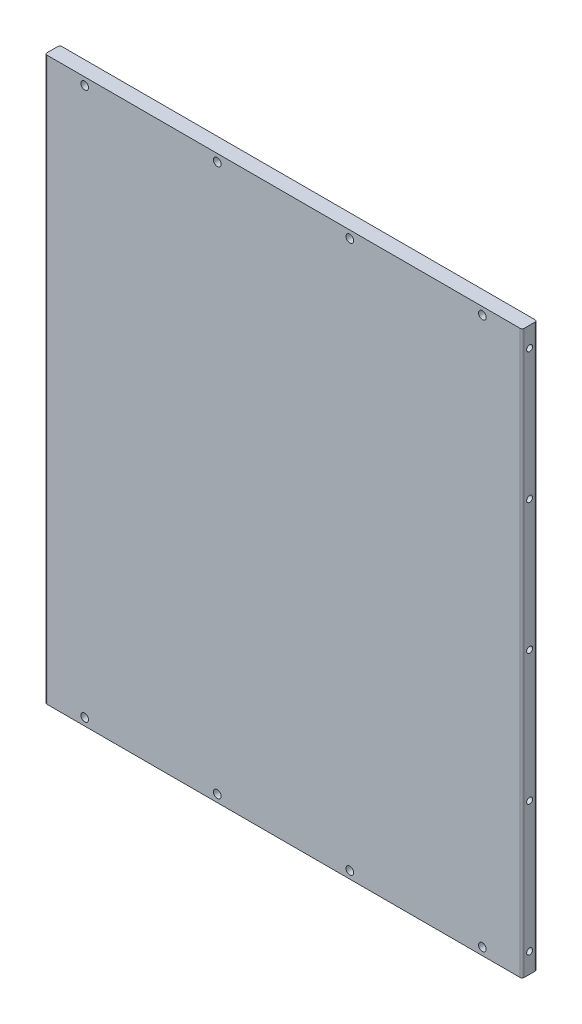
ISO-10303-21;
HEADER;
FILE_DESCRIPTION(('STEP AP214'),'2;1');
FILE_NAME('part.step','',(''),(''),'','','');
FILE_SCHEMA(('AUTOMOTIVE_DESIGN { 1 0 10303 214 1 1 1 1 }'));
ENDSEC;
DATA;
#1=APPLICATION_CONTEXT('core data for automotive mechanical design processes');
#2=APPLICATION_PROTOCOL_DEFINITION('international standard','automotive_design',2000,#1);
#3=PRODUCT_CONTEXT('',#1,'mechanical');
#4=PRODUCT('Part','Part','',(#3));
#5=PRODUCT_RELATED_PRODUCT_CATEGORY('part','',(#4));
#6=PRODUCT_DEFINITION_FORMATION('','',#4);
#7=PRODUCT_DEFINITION_CONTEXT('part definition',#1,'design');
#8=PRODUCT_DEFINITION('design','',#6,#7);
#9=PRODUCT_DEFINITION_SHAPE('','',#8);
#10=(LENGTH_UNIT() NAMED_UNIT(*) SI_UNIT(.MILLI.,.METRE.));
#11=(NAMED_UNIT(*) PLANE_ANGLE_UNIT() SI_UNIT($,.RADIAN.));
#12=(NAMED_UNIT(*) SI_UNIT($,.STERADIAN.) SOLID_ANGLE_UNIT());
#13=UNCERTAINTY_MEASURE_WITH_UNIT(LENGTH_MEASURE(1.E-05),#10,'distance_accuracy_value','');
#14=(GEOMETRIC_REPRESENTATION_CONTEXT(3) GLOBAL_UNCERTAINTY_ASSIGNED_CONTEXT((#13)) GLOBAL_UNIT_ASSIGNED_CONTEXT((#10,
#11,#12)) REPRESENTATION_CONTEXT('',''));
#15=CARTESIAN_POINT('',(0.,0.,0.));
#16=DIRECTION('',(0.,0.,1.));
#17=DIRECTION('',(1.,0.,0.));
#18=AXIS2_PLACEMENT_3D('',#15,#16,#17);
#19=CARTESIAN_POINT('',(49.649999330973,-424.525,9.525));
#20=DIRECTION('',(-1.,0.,0.));
#21=DIRECTION('',(0.,-1.,0.));
#22=AXIS2_PLACEMENT_3D('',#19,#20,#21);
#23=PLANE('',#22);
#24=CARTESIAN_POINT('',(49.649999330973,-411.825,4.76249999999997));
#25=DIRECTION('',(1.,0.,0.));
#26=DIRECTION('',(0.,0.,-1.));
#27=AXIS2_PLACEMENT_3D('',#24,#25,#26);
#28=CIRCLE('',#27,1.89864999999995);
#29=CARTESIAN_POINT('',(49.649999330973,-411.825,2.86385000000002));
#30=VERTEX_POINT('',#29);
#31=EDGE_CURVE('E234',#30,#30,#28,.T.);
#32=ORIENTED_EDGE('',*,*,#31,.F.);
#33=EDGE_LOOP('',(#32));
#34=FACE_BOUND('',#33,.T.);
#35=CARTESIAN_POINT('',(49.649999330973,-328.4125,4.76249999999998));
#36=DIRECTION('',(1.,0.,0.));
#37=DIRECTION('',(0.,0.,-1.));
#38=AXIS2_PLACEMENT_3D('',#35,#36,#37);
#39=CIRCLE('',#38,1.89864999999995);
#40=CARTESIAN_POINT('',(49.649999330973,-328.4125,2.86385000000003));
#41=VERTEX_POINT('',#40);
#42=EDGE_CURVE('E240',#41,#41,#39,.T.);
#43=ORIENTED_EDGE('',*,*,#42,.F.);
#44=EDGE_LOOP('',(#43));
#45=FACE_BOUND('',#44,.T.);
#46=CARTESIAN_POINT('',(49.649999330973,-245.,4.76249999999999));
#47=DIRECTION('',(1.,0.,0.));
#48=DIRECTION('',(0.,0.,-1.));
#49=AXIS2_PLACEMENT_3D('',#46,#47,#48);
#50=CIRCLE('',#49,1.89864999999997);
#51=CARTESIAN_POINT('',(49.649999330973,-245.,2.86385000000001));
#52=VERTEX_POINT('',#51);
#53=EDGE_CURVE('E246',#52,#52,#50,.T.);
#54=ORIENTED_EDGE('',*,*,#53,.F.);
#55=EDGE_LOOP('',(#54));
#56=FACE_BOUND('',#55,.T.);
#57=CARTESIAN_POINT('',(49.6499993309729,-161.5875,4.7625));
#58=DIRECTION('',(1.,0.,0.));
#59=DIRECTION('',(0.,0.,-1.));
#60=AXIS2_PLACEMENT_3D('',#57,#58,#59);
#61=CIRCLE('',#60,1.89864999999997);
#62=CARTESIAN_POINT('',(49.6499993309729,-161.5875,2.86385000000003));
#63=VERTEX_POINT('',#62);
#64=EDGE_CURVE('E252',#63,#63,#61,.T.);
#65=ORIENTED_EDGE('',*,*,#64,.F.);
#66=EDGE_LOOP('',(#65));
#67=FACE_BOUND('',#66,.T.);
#68=CARTESIAN_POINT('',(49.6499993309729,-78.175,4.76250000000002));
#69=DIRECTION('',(1.,0.,0.));
#70=DIRECTION('',(0.,0.,-1.));
#71=AXIS2_PLACEMENT_3D('',#68,#69,#70);
#72=CIRCLE('',#71,1.89864999999996);
#73=CARTESIAN_POINT('',(49.6499993309729,-78.175,2.86385000000006));
#74=VERTEX_POINT('',#73);
#75=EDGE_CURVE('E258',#74,#74,#72,.T.);
#76=ORIENTED_EDGE('',*,*,#75,.F.);
#77=EDGE_LOOP('',(#76));
#78=FACE_BOUND('',#77,.T.);
#79=DIRECTION('',(0.,0.,-1.));
#80=VECTOR('',#79,1.);
#81=CARTESIAN_POINT('',(49.649999330973,-424.525,9.525));
#82=LINE('',#81,#80);
#83=CARTESIAN_POINT('',(49.649999330973,-424.525,8.255));
#84=VERTEX_POINT('',#83);
#85=CARTESIAN_POINT('',(49.649999330973,-424.525,1.27));
#86=VERTEX_POINT('',#85);
#87=EDGE_CURVE('E272',#84,#86,#82,.T.);
#88=ORIENTED_EDGE('',*,*,#87,.T.);
#89=DIRECTION('',(0.,1.,0.));
#90=VECTOR('',#89,1.);
#91=CARTESIAN_POINT('',(49.649999330973,-424.525,1.27));
#92=LINE('',#91,#90);
#93=CARTESIAN_POINT('',(49.6499993309729,-65.475,1.27));
#94=VERTEX_POINT('',#93);
#95=EDGE_CURVE('E11',#86,#94,#92,.T.);
#96=ORIENTED_EDGE('',*,*,#95,.T.);
#97=DIRECTION('',(0.,0.,-1.));
#98=VECTOR('',#97,1.);
#99=CARTESIAN_POINT('',(49.6499993309729,-65.475,9.525));
#100=LINE('',#99,#98);
#101=CARTESIAN_POINT('',(49.6499993309729,-65.475,8.255));
#102=VERTEX_POINT('',#101);
#103=EDGE_CURVE('E285',#102,#94,#100,.T.);
#104=ORIENTED_EDGE('',*,*,#103,.F.);
#105=DIRECTION('',(0.,1.,0.));
#106=VECTOR('',#105,1.);
#107=CARTESIAN_POINT('',(49.649999330973,-424.525,8.255));
#108=LINE('',#107,#106);
#109=EDGE_CURVE('E61',#102,#84,#108,.F.);
#110=ORIENTED_EDGE('',*,*,#109,.T.);
#111=EDGE_LOOP('',(#88,#96,#104,#110));
#112=FACE_BOUND('',#111,.T.);
#113=ADVANCED_FACE('F53',(#34,#45,#56,#67,#78,#112),#23,.F.);
#114=CARTESIAN_POINT('',(49.6499993309729,-65.475,9.525));
#115=DIRECTION('',(0.,-1.,0.));
#116=DIRECTION('',(1.,0.,0.));
#117=AXIS2_PLACEMENT_3D('',#114,#115,#116);
#118=PLANE('',#117);
#119=DIRECTION('',(-1.,0.,0.));
#120=VECTOR('',#119,1.);
#121=CARTESIAN_POINT('',(49.6499993309729,-65.475,0.));
#122=LINE('',#121,#120);
#123=CARTESIAN_POINT('',(48.3799993309729,-65.475,0.));
#124=VERTEX_POINT('',#123);
#125=CARTESIAN_POINT('',(-253.880000669027,-65.475,0.));
#126=VERTEX_POINT('',#125);
#127=EDGE_CURVE('E264',#124,#126,#122,.T.);
#128=ORIENTED_EDGE('',*,*,#127,.T.);
#129=CARTESIAN_POINT('',(-253.880000669027,-65.4750000000001,1.27));
#130=DIRECTION('',(0.,-1.,0.));
#131=DIRECTION('',(1.,0.,0.));
#132=AXIS2_PLACEMENT_3D('',#129,#130,#131);
#133=CIRCLE('',#132,1.27);
#134=CARTESIAN_POINT('',(-255.150000669027,-65.475,1.27));
#135=VERTEX_POINT('',#134);
#136=EDGE_CURVE('E308',#126,#135,#133,.F.);
#137=ORIENTED_EDGE('',*,*,#136,.T.);
#138=DIRECTION('',(0.,0.,-1.));
#139=VECTOR('',#138,1.);
#140=CARTESIAN_POINT('',(-255.150000669027,-65.475,9.525));
#141=LINE('',#140,#139);
#142=CARTESIAN_POINT('',(-255.150000669027,-65.475,8.255));
#143=VERTEX_POINT('',#142);
#144=EDGE_CURVE('E282',#143,#135,#141,.T.);
#145=ORIENTED_EDGE('',*,*,#144,.F.);
#146=CARTESIAN_POINT('',(-253.880000669027,-65.475,8.255));
#147=DIRECTION('',(0.,-1.,0.));
#148=DIRECTION('',(1.,0.,0.));
#149=AXIS2_PLACEMENT_3D('',#146,#147,#148);
#150=CIRCLE('',#149,1.27);
#151=CARTESIAN_POINT('',(-253.880000669027,-65.475,9.525));
#152=VERTEX_POINT('',#151);
#153=EDGE_CURVE('E306',#143,#152,#150,.F.);
#154=ORIENTED_EDGE('',*,*,#153,.T.);
#155=DIRECTION('',(-1.,0.,0.));
#156=VECTOR('',#155,1.);
#157=CARTESIAN_POINT('',(49.6499993309729,-65.475,9.525));
#158=LINE('',#157,#156);
#159=CARTESIAN_POINT('',(48.3799993309729,-65.475,9.525));
#160=VERTEX_POINT('',#159);
#161=EDGE_CURVE('E265',#160,#152,#158,.T.);
#162=ORIENTED_EDGE('',*,*,#161,.F.);
#163=CARTESIAN_POINT('',(48.3799993309729,-65.475,8.255));
#164=DIRECTION('',(0.,-1.,0.));
#165=DIRECTION('',(1.,0.,0.));
#166=AXIS2_PLACEMENT_3D('',#163,#164,#165);
#167=CIRCLE('',#166,1.27);
#168=EDGE_CURVE('E75',#160,#102,#167,.F.);
#169=ORIENTED_EDGE('',*,*,#168,.T.);
#170=ORIENTED_EDGE('',*,*,#103,.T.);
#171=CARTESIAN_POINT('',(48.3799993309729,-65.475,1.27));
#172=DIRECTION('',(0.,-1.,0.));
#173=DIRECTION('',(1.,0.,0.));
#174=AXIS2_PLACEMENT_3D('',#171,#172,#173);
#175=CIRCLE('',#174,1.27);
#176=EDGE_CURVE('E68',#94,#124,#175,.F.);
#177=ORIENTED_EDGE('',*,*,#176,.T.);
#178=EDGE_LOOP('',(#128,#137,#145,#154,#162,#169,#170,#177));
#179=FACE_BOUND('',#178,.T.);
#180=ADVANCED_FACE('F328',(#179),#118,.F.);
#181=CARTESIAN_POINT('',(-255.150000669027,-424.525,9.525));
#182=DIRECTION('',(1.,0.,0.));
#183=DIRECTION('',(0.,0.,-1.));
#184=AXIS2_PLACEMENT_3D('',#181,#182,#183);
#185=PLANE('',#184);
#186=CARTESIAN_POINT('',(-255.150000669027,-411.825,4.76249999999997));
#187=DIRECTION('',(-1.,0.,0.));
#188=DIRECTION('',(0.,0.,1.));
#189=AXIS2_PLACEMENT_3D('',#186,#187,#188);
#190=CIRCLE('',#189,1.89864999999995);
#191=CARTESIAN_POINT('',(-255.150000669027,-411.825,6.66114999999991));
#192=VERTEX_POINT('',#191);
#193=EDGE_CURVE('E158',#192,#192,#190,.T.);
#194=ORIENTED_EDGE('',*,*,#193,.F.);
#195=EDGE_LOOP('',(#194));
#196=FACE_BOUND('',#195,.T.);
#197=CARTESIAN_POINT('',(-255.150000669027,-328.4125,4.76249999999998));
#198=DIRECTION('',(-1.,0.,0.));
#199=DIRECTION('',(0.,0.,1.));
#200=AXIS2_PLACEMENT_3D('',#197,#198,#199);
#201=CIRCLE('',#200,1.89864999999995);
#202=CARTESIAN_POINT('',(-255.150000669027,-328.4125,6.66114999999992));
#203=VERTEX_POINT('',#202);
#204=EDGE_CURVE('E157',#203,#203,#201,.T.);
#205=ORIENTED_EDGE('',*,*,#204,.F.);
#206=EDGE_LOOP('',(#205));
#207=FACE_BOUND('',#206,.T.);
#208=CARTESIAN_POINT('',(-255.150000669027,-245.,4.76249999999999));
#209=DIRECTION('',(-1.,0.,0.));
#210=DIRECTION('',(0.,0.,1.));
#211=AXIS2_PLACEMENT_3D('',#208,#209,#210);
#212=CIRCLE('',#211,1.89864999999997);
#213=CARTESIAN_POINT('',(-255.150000669027,-245.,6.66114999999996));
#214=VERTEX_POINT('',#213);
#215=EDGE_CURVE('E168',#214,#214,#212,.T.);
#216=ORIENTED_EDGE('',*,*,#215,.F.);
#217=EDGE_LOOP('',(#216));
#218=FACE_BOUND('',#217,.T.);
#219=CARTESIAN_POINT('',(-255.150000669027,-161.5875,4.7625));
#220=DIRECTION('',(-1.,0.,0.));
#221=DIRECTION('',(0.,0.,1.));
#222=AXIS2_PLACEMENT_3D('',#219,#220,#221);
#223=CIRCLE('',#222,1.89864999999997);
#224=CARTESIAN_POINT('',(-255.150000669027,-161.5875,6.66114999999997));
#225=VERTEX_POINT('',#224);
#226=EDGE_CURVE('E174',#225,#225,#223,.T.);
#227=ORIENTED_EDGE('',*,*,#226,.F.);
#228=EDGE_LOOP('',(#227));
#229=FACE_BOUND('',#228,.T.);
#230=CARTESIAN_POINT('',(-255.150000669027,-78.175,4.76250000000002));
#231=DIRECTION('',(-1.,0.,0.));
#232=DIRECTION('',(0.,0.,1.));
#233=AXIS2_PLACEMENT_3D('',#230,#231,#232);
#234=CIRCLE('',#233,1.89864999999996);
#235=CARTESIAN_POINT('',(-255.150000669027,-78.175,6.66114999999998));
#236=VERTEX_POINT('',#235);
#237=EDGE_CURVE('E180',#236,#236,#234,.T.);
#238=ORIENTED_EDGE('',*,*,#237,.F.);
#239=EDGE_LOOP('',(#238));
#240=FACE_BOUND('',#239,.T.);
#241=ORIENTED_EDGE('',*,*,#144,.T.);
#242=DIRECTION('',(0.,-1.,0.));
#243=VECTOR('',#242,1.);
#244=CARTESIAN_POINT('',(-255.150000669027,-424.525,1.27));
#245=LINE('',#244,#243);
#246=CARTESIAN_POINT('',(-255.150000669027,-424.525,1.27));
#247=VERTEX_POINT('',#246);
#248=EDGE_CURVE('E289',#135,#247,#245,.T.);
#249=ORIENTED_EDGE('',*,*,#248,.T.);
#250=DIRECTION('',(0.,0.,-1.));
#251=VECTOR('',#250,1.);
#252=CARTESIAN_POINT('',(-255.150000669027,-424.525,9.525));
#253=LINE('',#252,#251);
#254=CARTESIAN_POINT('',(-255.150000669027,-424.525,8.255));
#255=VERTEX_POINT('',#254);
#256=EDGE_CURVE('E279',#255,#247,#253,.T.);
#257=ORIENTED_EDGE('',*,*,#256,.F.);
#258=DIRECTION('',(0.,-1.,0.));
#259=VECTOR('',#258,1.);
#260=CARTESIAN_POINT('',(-255.150000669027,-65.475,8.255));
#261=LINE('',#260,#259);
#262=EDGE_CURVE('E287',#255,#143,#261,.F.);
#263=ORIENTED_EDGE('',*,*,#262,.T.);
#264=EDGE_LOOP('',(#241,#249,#257,#263));
#265=FACE_BOUND('',#264,.T.);
#266=ADVANCED_FACE('F336',(#196,#207,#218,#229,#240,#265),#185,.F.);
#267=CARTESIAN_POINT('',(49.649999330973,-424.525,9.525));
#268=DIRECTION('',(0.,1.,0.));
#269=DIRECTION('',(-1.,0.,0.));
#270=AXIS2_PLACEMENT_3D('',#267,#268,#269);
#271=PLANE('',#270);
#272=ORIENTED_EDGE('',*,*,#256,.T.);
#273=CARTESIAN_POINT('',(-253.880000669027,-424.525,1.27));
#274=DIRECTION('',(0.,1.,0.));
#275=DIRECTION('',(-1.,0.,0.));
#276=AXIS2_PLACEMENT_3D('',#273,#274,#275);
#277=CIRCLE('',#276,1.27);
#278=CARTESIAN_POINT('',(-253.880000669027,-424.525,0.));
#279=VERTEX_POINT('',#278);
#280=EDGE_CURVE('E298',#247,#279,#277,.F.);
#281=ORIENTED_EDGE('',*,*,#280,.T.);
#282=DIRECTION('',(1.,0.,0.));
#283=VECTOR('',#282,1.);
#284=CARTESIAN_POINT('',(49.649999330973,-424.525,0.));
#285=LINE('',#284,#283);
#286=CARTESIAN_POINT('',(48.379999330973,-424.525,0.));
#287=VERTEX_POINT('',#286);
#288=EDGE_CURVE('E269',#279,#287,#285,.T.);
#289=ORIENTED_EDGE('',*,*,#288,.T.);
#290=CARTESIAN_POINT('',(48.379999330973,-424.525,1.27));
#291=DIRECTION('',(0.,1.,0.));
#292=DIRECTION('',(-1.,0.,0.));
#293=AXIS2_PLACEMENT_3D('',#290,#291,#292);
#294=CIRCLE('',#293,1.27);
#295=EDGE_CURVE('E294',#287,#86,#294,.F.);
#296=ORIENTED_EDGE('',*,*,#295,.T.);
#297=ORIENTED_EDGE('',*,*,#87,.F.);
#298=CARTESIAN_POINT('',(48.379999330973,-424.525,8.255));
#299=DIRECTION('',(0.,1.,0.));
#300=DIRECTION('',(-1.,0.,0.));
#301=AXIS2_PLACEMENT_3D('',#298,#299,#300);
#302=CIRCLE('',#301,1.27);
#303=CARTESIAN_POINT('',(48.379999330973,-424.525,9.525));
#304=VERTEX_POINT('',#303);
#305=EDGE_CURVE('E292',#84,#304,#302,.F.);
#306=ORIENTED_EDGE('',*,*,#305,.T.);
#307=DIRECTION('',(1.,0.,0.));
#308=VECTOR('',#307,1.);
#309=CARTESIAN_POINT('',(49.649999330973,-424.525,9.525));
#310=LINE('',#309,#308);
#311=CARTESIAN_POINT('',(-253.880000669027,-424.525,9.525));
#312=VERTEX_POINT('',#311);
#313=EDGE_CURVE('E268',#312,#304,#310,.T.);
#314=ORIENTED_EDGE('',*,*,#313,.F.);
#315=CARTESIAN_POINT('',(-253.880000669027,-424.525,8.255));
#316=DIRECTION('',(0.,1.,0.));
#317=DIRECTION('',(-1.,0.,0.));
#318=AXIS2_PLACEMENT_3D('',#315,#316,#317);
#319=CIRCLE('',#318,1.27);
#320=EDGE_CURVE('E296',#312,#255,#319,.F.);
#321=ORIENTED_EDGE('',*,*,#320,.T.);
#322=EDGE_LOOP('',(#272,#281,#289,#296,#297,#306,#314,#321));
#323=FACE_BOUND('',#322,.T.);
#324=ADVANCED_FACE('F321',(#323),#271,.F.);
#325=CARTESIAN_POINT('',(0.,0.,9.525));
#326=DIRECTION('',(0.,0.,1.));
#327=DIRECTION('',(1.,0.,0.));
#328=AXIS2_PLACEMENT_3D('',#325,#326,#327);
#329=PLANE('',#328);
#330=CARTESIAN_POINT('',(-229.750000669027,-70.2375,9.525));
#331=DIRECTION('',(0.,0.,1.));
#332=DIRECTION('',(1.,0.,0.));
#333=AXIS2_PLACEMENT_3D('',#330,#331,#332);
#334=CIRCLE('',#333,2.45745);
#335=CARTESIAN_POINT('',(-227.292550669027,-70.2375,9.525));
#336=VERTEX_POINT('',#335);
#337=EDGE_CURVE('E186',#336,#336,#334,.T.);
#338=ORIENTED_EDGE('',*,*,#337,.F.);
#339=EDGE_LOOP('',(#338));
#340=FACE_BOUND('',#339,.T.);
#341=CARTESIAN_POINT('',(-145.08333400236,-70.2375,9.525));
#342=DIRECTION('',(0.,0.,1.));
#343=DIRECTION('',(1.,0.,0.));
#344=AXIS2_PLACEMENT_3D('',#341,#342,#343);
#345=CIRCLE('',#344,2.45745);
#346=CARTESIAN_POINT('',(-142.62588400236,-70.2375,9.525));
#347=VERTEX_POINT('',#346);
#348=EDGE_CURVE('E192',#347,#347,#345,.T.);
#349=ORIENTED_EDGE('',*,*,#348,.F.);
#350=EDGE_LOOP('',(#349));
#351=FACE_BOUND('',#350,.T.);
#352=CARTESIAN_POINT('',(-60.4166673356938,-70.2375,9.525));
#353=DIRECTION('',(0.,0.,1.));
#354=DIRECTION('',(1.,0.,0.));
#355=AXIS2_PLACEMENT_3D('',#352,#353,#354);
#356=CIRCLE('',#355,2.45744999999999);
#357=CARTESIAN_POINT('',(-57.9592173356938,-70.2375,9.525));
#358=VERTEX_POINT('',#357);
#359=EDGE_CURVE('E198',#358,#358,#356,.T.);
#360=ORIENTED_EDGE('',*,*,#359,.F.);
#361=EDGE_LOOP('',(#360));
#362=FACE_BOUND('',#361,.T.);
#363=CARTESIAN_POINT('',(24.2499993309729,-70.2375,9.525));
#364=DIRECTION('',(0.,0.,1.));
#365=DIRECTION('',(1.,0.,0.));
#366=AXIS2_PLACEMENT_3D('',#363,#364,#365);
#367=CIRCLE('',#366,2.45744999999999);
#368=CARTESIAN_POINT('',(26.7074493309729,-70.2375,9.525));
#369=VERTEX_POINT('',#368);
#370=EDGE_CURVE('E204',#369,#369,#367,.T.);
#371=ORIENTED_EDGE('',*,*,#370,.F.);
#372=EDGE_LOOP('',(#371));
#373=FACE_BOUND('',#372,.T.);
#374=CARTESIAN_POINT('',(-229.750000669027,-419.7625,9.525));
#375=DIRECTION('',(0.,0.,1.));
#376=DIRECTION('',(1.,0.,0.));
#377=AXIS2_PLACEMENT_3D('',#374,#375,#376);
#378=CIRCLE('',#377,2.45745);
#379=CARTESIAN_POINT('',(-227.292550669027,-419.7625,9.525));
#380=VERTEX_POINT('',#379);
#381=EDGE_CURVE('E210',#380,#380,#378,.T.);
#382=ORIENTED_EDGE('',*,*,#381,.F.);
#383=EDGE_LOOP('',(#382));
#384=FACE_BOUND('',#383,.T.);
#385=CARTESIAN_POINT('',(-145.08333400236,-419.7625,9.525));
#386=DIRECTION('',(0.,0.,1.));
#387=DIRECTION('',(1.,0.,0.));
#388=AXIS2_PLACEMENT_3D('',#385,#386,#387);
#389=CIRCLE('',#388,2.45745);
#390=CARTESIAN_POINT('',(-142.62588400236,-419.7625,9.525));
#391=VERTEX_POINT('',#390);
#392=EDGE_CURVE('E216',#391,#391,#389,.T.);
#393=ORIENTED_EDGE('',*,*,#392,.F.);
#394=EDGE_LOOP('',(#393));
#395=FACE_BOUND('',#394,.T.);
#396=CARTESIAN_POINT('',(-60.4166673356938,-419.7625,9.525));
#397=DIRECTION('',(0.,0.,1.));
#398=DIRECTION('',(1.,0.,0.));
#399=AXIS2_PLACEMENT_3D('',#396,#397,#398);
#400=CIRCLE('',#399,2.45744999999999);
#401=CARTESIAN_POINT('',(-57.9592173356938,-419.7625,9.525));
#402=VERTEX_POINT('',#401);
#403=EDGE_CURVE('E222',#402,#402,#400,.T.);
#404=ORIENTED_EDGE('',*,*,#403,.F.);
#405=EDGE_LOOP('',(#404));
#406=FACE_BOUND('',#405,.T.);
#407=CARTESIAN_POINT('',(24.249999330973,-419.7625,9.525));
#408=DIRECTION('',(0.,0.,1.));
#409=DIRECTION('',(1.,0.,0.));
#410=AXIS2_PLACEMENT_3D('',#407,#408,#409);
#411=CIRCLE('',#410,2.45744999999999);
#412=CARTESIAN_POINT('',(26.707449330973,-419.7625,9.525));
#413=VERTEX_POINT('',#412);
#414=EDGE_CURVE('E228',#413,#413,#411,.T.);
#415=ORIENTED_EDGE('',*,*,#414,.F.);
#416=EDGE_LOOP('',(#415));
#417=FACE_BOUND('',#416,.T.);
#418=ORIENTED_EDGE('',*,*,#161,.T.);
#419=DIRECTION('',(0.,-1.,0.));
#420=VECTOR('',#419,1.);
#421=CARTESIAN_POINT('',(-253.880000669027,-424.525,9.525));
#422=LINE('',#421,#420);
#423=EDGE_CURVE('E313',#152,#312,#422,.T.);
#424=ORIENTED_EDGE('',*,*,#423,.T.);
#425=ORIENTED_EDGE('',*,*,#313,.T.);
#426=DIRECTION('',(0.,1.,0.));
#427=VECTOR('',#426,1.);
#428=CARTESIAN_POINT('',(48.3799993309729,-65.475,9.525));
#429=LINE('',#428,#427);
#430=EDGE_CURVE('E310',#304,#160,#429,.T.);
#431=ORIENTED_EDGE('',*,*,#430,.T.);
#432=EDGE_LOOP('',(#418,#424,#425,#431));
#433=FACE_BOUND('',#432,.T.);
#434=ADVANCED_FACE('F326',(#340,#351,#362,#373,#384,#395,#406,#417,#433),#329,.T.);
#435=CARTESIAN_POINT('',(0.,0.,0.));
#436=DIRECTION('',(0.,0.,1.));
#437=DIRECTION('',(1.,0.,0.));
#438=AXIS2_PLACEMENT_3D('',#435,#436,#437);
#439=PLANE('',#438);
#440=CARTESIAN_POINT('',(-229.750000669027,-70.2375,0.));
#441=DIRECTION('',(0.,0.,1.));
#442=DIRECTION('',(1.,0.,0.));
#443=AXIS2_PLACEMENT_3D('',#440,#441,#442);
#444=CIRCLE('',#443,2.45745);
#445=CARTESIAN_POINT('',(-227.292550669027,-70.2375,0.));
#446=VERTEX_POINT('',#445);
#447=EDGE_CURVE('E189',#446,#446,#444,.T.);
#448=ORIENTED_EDGE('',*,*,#447,.T.);
#449=EDGE_LOOP('',(#448));
#450=FACE_BOUND('',#449,.T.);
#451=CARTESIAN_POINT('',(-145.08333400236,-70.2375,0.));
#452=DIRECTION('',(0.,0.,1.));
#453=DIRECTION('',(1.,0.,0.));
#454=AXIS2_PLACEMENT_3D('',#451,#452,#453);
#455=CIRCLE('',#454,2.45745);
#456=CARTESIAN_POINT('',(-142.62588400236,-70.2375,0.));
#457=VERTEX_POINT('',#456);
#458=EDGE_CURVE('E195',#457,#457,#455,.T.);
#459=ORIENTED_EDGE('',*,*,#458,.T.);
#460=EDGE_LOOP('',(#459));
#461=FACE_BOUND('',#460,.T.);
#462=CARTESIAN_POINT('',(-60.4166673356938,-70.2375,0.));
#463=DIRECTION('',(0.,0.,1.));
#464=DIRECTION('',(1.,0.,0.));
#465=AXIS2_PLACEMENT_3D('',#462,#463,#464);
#466=CIRCLE('',#465,2.45745);
#467=CARTESIAN_POINT('',(-57.9592173356938,-70.2375,0.));
#468=VERTEX_POINT('',#467);
#469=EDGE_CURVE('E201',#468,#468,#466,.T.);
#470=ORIENTED_EDGE('',*,*,#469,.T.);
#471=EDGE_LOOP('',(#470));
#472=FACE_BOUND('',#471,.T.);
#473=CARTESIAN_POINT('',(24.2499993309729,-70.2375,0.));
#474=DIRECTION('',(0.,0.,1.));
#475=DIRECTION('',(1.,0.,0.));
#476=AXIS2_PLACEMENT_3D('',#473,#474,#475);
#477=CIRCLE('',#476,2.45745);
#478=CARTESIAN_POINT('',(26.7074493309729,-70.2375,0.));
#479=VERTEX_POINT('',#478);
#480=EDGE_CURVE('E207',#479,#479,#477,.T.);
#481=ORIENTED_EDGE('',*,*,#480,.T.);
#482=EDGE_LOOP('',(#481));
#483=FACE_BOUND('',#482,.T.);
#484=CARTESIAN_POINT('',(-229.750000669027,-419.7625,0.));
#485=DIRECTION('',(0.,0.,1.));
#486=DIRECTION('',(1.,0.,0.));
#487=AXIS2_PLACEMENT_3D('',#484,#485,#486);
#488=CIRCLE('',#487,2.45745);
#489=CARTESIAN_POINT('',(-227.292550669027,-419.7625,0.));
#490=VERTEX_POINT('',#489);
#491=EDGE_CURVE('E213',#490,#490,#488,.T.);
#492=ORIENTED_EDGE('',*,*,#491,.T.);
#493=EDGE_LOOP('',(#492));
#494=FACE_BOUND('',#493,.T.);
#495=CARTESIAN_POINT('',(-145.08333400236,-419.7625,0.));
#496=DIRECTION('',(0.,0.,1.));
#497=DIRECTION('',(1.,0.,0.));
#498=AXIS2_PLACEMENT_3D('',#495,#496,#497);
#499=CIRCLE('',#498,2.45745);
#500=CARTESIAN_POINT('',(-142.62588400236,-419.7625,0.));
#501=VERTEX_POINT('',#500);
#502=EDGE_CURVE('E219',#501,#501,#499,.T.);
#503=ORIENTED_EDGE('',*,*,#502,.T.);
#504=EDGE_LOOP('',(#503));
#505=FACE_BOUND('',#504,.T.);
#506=CARTESIAN_POINT('',(-60.4166673356938,-419.7625,0.));
#507=DIRECTION('',(0.,0.,1.));
#508=DIRECTION('',(1.,0.,0.));
#509=AXIS2_PLACEMENT_3D('',#506,#507,#508);
#510=CIRCLE('',#509,2.45745);
#511=CARTESIAN_POINT('',(-57.9592173356938,-419.7625,0.));
#512=VERTEX_POINT('',#511);
#513=EDGE_CURVE('E225',#512,#512,#510,.T.);
#514=ORIENTED_EDGE('',*,*,#513,.T.);
#515=EDGE_LOOP('',(#514));
#516=FACE_BOUND('',#515,.T.);
#517=CARTESIAN_POINT('',(24.249999330973,-419.7625,0.));
#518=DIRECTION('',(0.,0.,1.));
#519=DIRECTION('',(1.,0.,0.));
#520=AXIS2_PLACEMENT_3D('',#517,#518,#519);
#521=CIRCLE('',#520,2.45745);
#522=CARTESIAN_POINT('',(26.707449330973,-419.7625,0.));
#523=VERTEX_POINT('',#522);
#524=EDGE_CURVE('E231',#523,#523,#521,.T.);
#525=ORIENTED_EDGE('',*,*,#524,.T.);
#526=EDGE_LOOP('',(#525));
#527=FACE_BOUND('',#526,.T.);
#528=ORIENTED_EDGE('',*,*,#288,.F.);
#529=DIRECTION('',(0.,-1.,0.));
#530=VECTOR('',#529,1.);
#531=CARTESIAN_POINT('',(-253.880000669027,0.,0.));
#532=LINE('',#531,#530);
#533=EDGE_CURVE('E302',#279,#126,#532,.F.);
#534=ORIENTED_EDGE('',*,*,#533,.T.);
#535=ORIENTED_EDGE('',*,*,#127,.F.);
#536=DIRECTION('',(0.,1.,0.));
#537=VECTOR('',#536,1.);
#538=CARTESIAN_POINT('',(48.3799993309729,0.,0.));
#539=LINE('',#538,#537);
#540=EDGE_CURVE('E300',#124,#287,#539,.F.);
#541=ORIENTED_EDGE('',*,*,#540,.T.);
#542=EDGE_LOOP('',(#528,#534,#535,#541));
#543=FACE_BOUND('',#542,.T.);
#544=ADVANCED_FACE('F344',(#450,#461,#472,#483,#494,#505,#516,#527,#543),#439,.F.);
#545=CARTESIAN_POINT('',(30.5999993309729,-78.175,4.76250000000002));
#546=DIRECTION('',(1.,0.,0.));
#547=DIRECTION('',(0.,0.,-1.));
#548=AXIS2_PLACEMENT_3D('',#545,#546,#547);
#549=CONICAL_SURFACE('',#548,1.89865,1.02974425867665);
#550=CARTESIAN_POINT('',(29.4591753166562,-78.175,4.76250000000002));
#551=VERTEX_POINT('',#550);
#552=VERTEX_LOOP('',#551);
#553=FACE_BOUND('',#552,.T.);
#554=CARTESIAN_POINT('',(30.5999993309729,-78.175,4.76250000000002));
#555=DIRECTION('',(1.,0.,0.));
#556=DIRECTION('',(0.,0.,-1.));
#557=AXIS2_PLACEMENT_3D('',#554,#555,#556);
#558=CIRCLE('',#557,1.89865);
#559=CARTESIAN_POINT('',(30.5999993309729,-78.175,2.86385000000001));
#560=VERTEX_POINT('',#559);
#561=EDGE_CURVE('E261',#560,#560,#558,.T.);
#562=ORIENTED_EDGE('',*,*,#561,.T.);
#563=EDGE_LOOP('',(#562));
#564=FACE_BOUND('',#563,.T.);
#565=ADVANCED_FACE('F473',(#553,#564),#549,.F.);
#566=CARTESIAN_POINT('',(49.6499993309729,-78.175,4.76250000000002));
#567=DIRECTION('',(1.,0.,0.));
#568=DIRECTION('',(0.,0.,-1.));
#569=AXIS2_PLACEMENT_3D('',#566,#567,#568);
#570=CYLINDRICAL_SURFACE('',#569,1.89864999999998);
#571=ORIENTED_EDGE('',*,*,#561,.F.);
#572=EDGE_LOOP('',(#571));
#573=FACE_BOUND('',#572,.T.);
#574=ORIENTED_EDGE('',*,*,#75,.T.);
#575=EDGE_LOOP('',(#574));
#576=FACE_BOUND('',#575,.T.);
#577=ADVANCED_FACE('F469',(#573,#576),#570,.F.);
#578=CARTESIAN_POINT('',(30.5999993309729,-161.5875,4.7625));
#579=DIRECTION('',(1.,0.,0.));
#580=DIRECTION('',(0.,0.,-1.));
#581=AXIS2_PLACEMENT_3D('',#578,#579,#580);
#582=CONICAL_SURFACE('',#581,1.89865,1.02974425867665);
#583=CARTESIAN_POINT('',(29.4591753166563,-161.5875,4.7625));
#584=VERTEX_POINT('',#583);
#585=VERTEX_LOOP('',#584);
#586=FACE_BOUND('',#585,.T.);
#587=CARTESIAN_POINT('',(30.5999993309729,-161.5875,4.7625));
#588=DIRECTION('',(1.,0.,0.));
#589=DIRECTION('',(0.,0.,-1.));
#590=AXIS2_PLACEMENT_3D('',#587,#588,#589);
#591=CIRCLE('',#590,1.89865);
#592=CARTESIAN_POINT('',(30.5999993309729,-161.5875,2.86385));
#593=VERTEX_POINT('',#592);
#594=EDGE_CURVE('E255',#593,#593,#591,.T.);
#595=ORIENTED_EDGE('',*,*,#594,.T.);
#596=EDGE_LOOP('',(#595));
#597=FACE_BOUND('',#596,.T.);
#598=ADVANCED_FACE('F465',(#586,#597),#582,.F.);
#599=CARTESIAN_POINT('',(49.6499993309729,-161.5875,4.7625));
#600=DIRECTION('',(1.,0.,0.));
#601=DIRECTION('',(0.,0.,-1.));
#602=AXIS2_PLACEMENT_3D('',#599,#600,#601);
#603=CYLINDRICAL_SURFACE('',#602,1.89864999999999);
#604=ORIENTED_EDGE('',*,*,#594,.F.);
#605=EDGE_LOOP('',(#604));
#606=FACE_BOUND('',#605,.T.);
#607=ORIENTED_EDGE('',*,*,#64,.T.);
#608=EDGE_LOOP('',(#607));
#609=FACE_BOUND('',#608,.T.);
#610=ADVANCED_FACE('F461',(#606,#609),#603,.F.);
#611=CARTESIAN_POINT('',(30.599999330973,-245.,4.76249999999999));
#612=DIRECTION('',(1.,0.,0.));
#613=DIRECTION('',(0.,0.,-1.));
#614=AXIS2_PLACEMENT_3D('',#611,#612,#613);
#615=CONICAL_SURFACE('',#614,1.89865,1.02974425867665);
#616=CARTESIAN_POINT('',(29.4591753166563,-245.,4.76249999999999));
#617=VERTEX_POINT('',#616);
#618=VERTEX_LOOP('',#617);
#619=FACE_BOUND('',#618,.T.);
#620=CARTESIAN_POINT('',(30.599999330973,-245.,4.76249999999999));
#621=DIRECTION('',(1.,0.,0.));
#622=DIRECTION('',(0.,0.,-1.));
#623=AXIS2_PLACEMENT_3D('',#620,#621,#622);
#624=CIRCLE('',#623,1.89865);
#625=CARTESIAN_POINT('',(30.599999330973,-245.,2.86384999999999));
#626=VERTEX_POINT('',#625);
#627=EDGE_CURVE('E249',#626,#626,#624,.T.);
#628=ORIENTED_EDGE('',*,*,#627,.T.);
#629=EDGE_LOOP('',(#628));
#630=FACE_BOUND('',#629,.T.);
#631=ADVANCED_FACE('F457',(#619,#630),#615,.F.);
#632=CARTESIAN_POINT('',(49.649999330973,-245.,4.76249999999999));
#633=DIRECTION('',(1.,0.,0.));
#634=DIRECTION('',(0.,0.,-1.));
#635=AXIS2_PLACEMENT_3D('',#632,#633,#634);
#636=CYLINDRICAL_SURFACE('',#635,1.89864999999999);
#637=ORIENTED_EDGE('',*,*,#627,.F.);
#638=EDGE_LOOP('',(#637));
#639=FACE_BOUND('',#638,.T.);
#640=ORIENTED_EDGE('',*,*,#53,.T.);
#641=EDGE_LOOP('',(#640));
#642=FACE_BOUND('',#641,.T.);
#643=ADVANCED_FACE('F453',(#639,#642),#636,.F.);
#644=CARTESIAN_POINT('',(30.599999330973,-328.4125,4.76249999999998));
#645=DIRECTION('',(1.,0.,0.));
#646=DIRECTION('',(0.,0.,-1.));
#647=AXIS2_PLACEMENT_3D('',#644,#645,#646);
#648=CONICAL_SURFACE('',#647,1.89865,1.02974425867665);
#649=CARTESIAN_POINT('',(29.4591753166563,-328.4125,4.76249999999998));
#650=VERTEX_POINT('',#649);
#651=VERTEX_LOOP('',#650);
#652=FACE_BOUND('',#651,.T.);
#653=CARTESIAN_POINT('',(30.599999330973,-328.4125,4.76249999999998));
#654=DIRECTION('',(1.,0.,0.));
#655=DIRECTION('',(0.,0.,-1.));
#656=AXIS2_PLACEMENT_3D('',#653,#654,#655);
#657=CIRCLE('',#656,1.89865);
#658=CARTESIAN_POINT('',(30.599999330973,-328.4125,2.86384999999998));
#659=VERTEX_POINT('',#658);
#660=EDGE_CURVE('E243',#659,#659,#657,.T.);
#661=ORIENTED_EDGE('',*,*,#660,.T.);
#662=EDGE_LOOP('',(#661));
#663=FACE_BOUND('',#662,.T.);
#664=ADVANCED_FACE('F449',(#652,#663),#648,.F.);
#665=CARTESIAN_POINT('',(49.649999330973,-328.4125,4.76249999999998));
#666=DIRECTION('',(1.,0.,0.));
#667=DIRECTION('',(0.,0.,-1.));
#668=AXIS2_PLACEMENT_3D('',#665,#666,#667);
#669=CYLINDRICAL_SURFACE('',#668,1.89864999999997);
#670=ORIENTED_EDGE('',*,*,#660,.F.);
#671=EDGE_LOOP('',(#670));
#672=FACE_BOUND('',#671,.T.);
#673=ORIENTED_EDGE('',*,*,#42,.T.);
#674=EDGE_LOOP('',(#673));
#675=FACE_BOUND('',#674,.T.);
#676=ADVANCED_FACE('F445',(#672,#675),#669,.F.);
#677=CARTESIAN_POINT('',(30.599999330973,-411.825,4.76249999999997));
#678=DIRECTION('',(1.,0.,0.));
#679=DIRECTION('',(0.,0.,-1.));
#680=AXIS2_PLACEMENT_3D('',#677,#678,#679);
#681=CONICAL_SURFACE('',#680,1.89865,1.02974425867665);
#682=CARTESIAN_POINT('',(29.4591753166563,-411.825,4.76249999999997));
#683=VERTEX_POINT('',#682);
#684=VERTEX_LOOP('',#683);
#685=FACE_BOUND('',#684,.T.);
#686=CARTESIAN_POINT('',(30.599999330973,-411.825,4.76249999999997));
#687=DIRECTION('',(1.,0.,0.));
#688=DIRECTION('',(0.,0.,-1.));
#689=AXIS2_PLACEMENT_3D('',#686,#687,#688);
#690=CIRCLE('',#689,1.89865);
#691=CARTESIAN_POINT('',(30.599999330973,-411.825,2.86384999999997));
#692=VERTEX_POINT('',#691);
#693=EDGE_CURVE('E237',#692,#692,#690,.T.);
#694=ORIENTED_EDGE('',*,*,#693,.T.);
#695=EDGE_LOOP('',(#694));
#696=FACE_BOUND('',#695,.T.);
#697=ADVANCED_FACE('F441',(#685,#696),#681,.F.);
#698=CARTESIAN_POINT('',(49.649999330973,-411.825,4.76249999999997));
#699=DIRECTION('',(1.,0.,0.));
#700=DIRECTION('',(0.,0.,-1.));
#701=AXIS2_PLACEMENT_3D('',#698,#699,#700);
#702=CYLINDRICAL_SURFACE('',#701,1.89864999999997);
#703=ORIENTED_EDGE('',*,*,#693,.F.);
#704=EDGE_LOOP('',(#703));
#705=FACE_BOUND('',#704,.T.);
#706=ORIENTED_EDGE('',*,*,#31,.T.);
#707=EDGE_LOOP('',(#706));
#708=FACE_BOUND('',#707,.T.);
#709=ADVANCED_FACE('F437',(#705,#708),#702,.F.);
#710=CARTESIAN_POINT('',(24.249999330973,-419.7625,9.525));
#711=DIRECTION('',(0.,0.,1.));
#712=DIRECTION('',(1.,0.,0.));
#713=AXIS2_PLACEMENT_3D('',#710,#711,#712);
#714=CYLINDRICAL_SURFACE('',#713,2.45744999999999);
#715=ORIENTED_EDGE('',*,*,#524,.F.);
#716=EDGE_LOOP('',(#715));
#717=FACE_BOUND('',#716,.T.);
#718=ORIENTED_EDGE('',*,*,#414,.T.);
#719=EDGE_LOOP('',(#718));
#720=FACE_BOUND('',#719,.T.);
#721=ADVANCED_FACE('F433',(#717,#720),#714,.F.);
#722=CARTESIAN_POINT('',(-60.4166673356938,-419.7625,9.525));
#723=DIRECTION('',(0.,0.,1.));
#724=DIRECTION('',(1.,0.,0.));
#725=AXIS2_PLACEMENT_3D('',#722,#723,#724);
#726=CYLINDRICAL_SURFACE('',#725,2.45744999999999);
#727=ORIENTED_EDGE('',*,*,#513,.F.);
#728=EDGE_LOOP('',(#727));
#729=FACE_BOUND('',#728,.T.);
#730=ORIENTED_EDGE('',*,*,#403,.T.);
#731=EDGE_LOOP('',(#730));
#732=FACE_BOUND('',#731,.T.);
#733=ADVANCED_FACE('F429',(#729,#732),#726,.F.);
#734=CARTESIAN_POINT('',(-145.08333400236,-419.7625,9.525));
#735=DIRECTION('',(0.,0.,1.));
#736=DIRECTION('',(1.,0.,0.));
#737=AXIS2_PLACEMENT_3D('',#734,#735,#736);
#738=CYLINDRICAL_SURFACE('',#737,2.45745);
#739=ORIENTED_EDGE('',*,*,#502,.F.);
#740=EDGE_LOOP('',(#739));
#741=FACE_BOUND('',#740,.T.);
#742=ORIENTED_EDGE('',*,*,#392,.T.);
#743=EDGE_LOOP('',(#742));
#744=FACE_BOUND('',#743,.T.);
#745=ADVANCED_FACE('F425',(#741,#744),#738,.F.);
#746=CARTESIAN_POINT('',(-229.750000669027,-419.7625,9.525));
#747=DIRECTION('',(0.,0.,1.));
#748=DIRECTION('',(1.,0.,0.));
#749=AXIS2_PLACEMENT_3D('',#746,#747,#748);
#750=CYLINDRICAL_SURFACE('',#749,2.45745);
#751=ORIENTED_EDGE('',*,*,#491,.F.);
#752=EDGE_LOOP('',(#751));
#753=FACE_BOUND('',#752,.T.);
#754=ORIENTED_EDGE('',*,*,#381,.T.);
#755=EDGE_LOOP('',(#754));
#756=FACE_BOUND('',#755,.T.);
#757=ADVANCED_FACE('F421',(#753,#756),#750,.F.);
#758=CARTESIAN_POINT('',(24.2499993309729,-70.2375,9.525));
#759=DIRECTION('',(0.,0.,1.));
#760=DIRECTION('',(1.,0.,0.));
#761=AXIS2_PLACEMENT_3D('',#758,#759,#760);
#762=CYLINDRICAL_SURFACE('',#761,2.45744999999999);
#763=ORIENTED_EDGE('',*,*,#480,.F.);
#764=EDGE_LOOP('',(#763));
#765=FACE_BOUND('',#764,.T.);
#766=ORIENTED_EDGE('',*,*,#370,.T.);
#767=EDGE_LOOP('',(#766));
#768=FACE_BOUND('',#767,.T.);
#769=ADVANCED_FACE('F417',(#765,#768),#762,.F.);
#770=CARTESIAN_POINT('',(-60.4166673356938,-70.2375,9.525));
#771=DIRECTION('',(0.,0.,1.));
#772=DIRECTION('',(1.,0.,0.));
#773=AXIS2_PLACEMENT_3D('',#770,#771,#772);
#774=CYLINDRICAL_SURFACE('',#773,2.45744999999999);
#775=ORIENTED_EDGE('',*,*,#469,.F.);
#776=EDGE_LOOP('',(#775));
#777=FACE_BOUND('',#776,.T.);
#778=ORIENTED_EDGE('',*,*,#359,.T.);
#779=EDGE_LOOP('',(#778));
#780=FACE_BOUND('',#779,.T.);
#781=ADVANCED_FACE('F413',(#777,#780),#774,.F.);
#782=CARTESIAN_POINT('',(-145.08333400236,-70.2375,9.525));
#783=DIRECTION('',(0.,0.,1.));
#784=DIRECTION('',(1.,0.,0.));
#785=AXIS2_PLACEMENT_3D('',#782,#783,#784);
#786=CYLINDRICAL_SURFACE('',#785,2.45745);
#787=ORIENTED_EDGE('',*,*,#458,.F.);
#788=EDGE_LOOP('',(#787));
#789=FACE_BOUND('',#788,.T.);
#790=ORIENTED_EDGE('',*,*,#348,.T.);
#791=EDGE_LOOP('',(#790));
#792=FACE_BOUND('',#791,.T.);
#793=ADVANCED_FACE('F409',(#789,#792),#786,.F.);
#794=CARTESIAN_POINT('',(-229.750000669027,-70.2375,9.525));
#795=DIRECTION('',(0.,0.,1.));
#796=DIRECTION('',(1.,0.,0.));
#797=AXIS2_PLACEMENT_3D('',#794,#795,#796);
#798=CYLINDRICAL_SURFACE('',#797,2.45745);
#799=ORIENTED_EDGE('',*,*,#447,.F.);
#800=EDGE_LOOP('',(#799));
#801=FACE_BOUND('',#800,.T.);
#802=ORIENTED_EDGE('',*,*,#337,.T.);
#803=EDGE_LOOP('',(#802));
#804=FACE_BOUND('',#803,.T.);
#805=ADVANCED_FACE('F405',(#801,#804),#798,.F.);
#806=CARTESIAN_POINT('',(-236.100000669027,-78.175,4.76250000000002));
#807=DIRECTION('',(-1.,0.,0.));
#808=DIRECTION('',(0.,0.,1.));
#809=AXIS2_PLACEMENT_3D('',#806,#807,#808);
#810=CONICAL_SURFACE('',#809,1.89865,1.02974425867666);
#811=CARTESIAN_POINT('',(-234.95917665471,-78.175,4.76250000000002));
#812=VERTEX_POINT('',#811);
#813=VERTEX_LOOP('',#812);
#814=FACE_BOUND('',#813,.T.);
#815=CARTESIAN_POINT('',(-236.100000669027,-78.175,4.76250000000002));
#816=DIRECTION('',(-1.,0.,0.));
#817=DIRECTION('',(0.,0.,1.));
#818=AXIS2_PLACEMENT_3D('',#815,#816,#817);
#819=CIRCLE('',#818,1.89865);
#820=CARTESIAN_POINT('',(-236.100000669027,-78.175,6.66115000000002));
#821=VERTEX_POINT('',#820);
#822=EDGE_CURVE('E183',#821,#821,#819,.T.);
#823=ORIENTED_EDGE('',*,*,#822,.T.);
#824=EDGE_LOOP('',(#823));
#825=FACE_BOUND('',#824,.T.);
#826=ADVANCED_FACE('F401',(#814,#825),#810,.F.);
#827=CARTESIAN_POINT('',(-255.150000669027,-78.175,4.76250000000002));
#828=DIRECTION('',(-1.,0.,0.));
#829=DIRECTION('',(0.,0.,1.));
#830=AXIS2_PLACEMENT_3D('',#827,#828,#829);
#831=CYLINDRICAL_SURFACE('',#830,1.89864999999998);
#832=ORIENTED_EDGE('',*,*,#822,.F.);
#833=EDGE_LOOP('',(#832));
#834=FACE_BOUND('',#833,.T.);
#835=ORIENTED_EDGE('',*,*,#237,.T.);
#836=EDGE_LOOP('',(#835));
#837=FACE_BOUND('',#836,.T.);
#838=ADVANCED_FACE('F397',(#834,#837),#831,.F.);
#839=CARTESIAN_POINT('',(-236.100000669027,-161.5875,4.7625));
#840=DIRECTION('',(-1.,0.,0.));
#841=DIRECTION('',(0.,0.,1.));
#842=AXIS2_PLACEMENT_3D('',#839,#840,#841);
#843=CONICAL_SURFACE('',#842,1.89865,1.02974425867666);
#844=CARTESIAN_POINT('',(-234.95917665471,-161.5875,4.7625));
#845=VERTEX_POINT('',#844);
#846=VERTEX_LOOP('',#845);
#847=FACE_BOUND('',#846,.T.);
#848=CARTESIAN_POINT('',(-236.100000669027,-161.5875,4.7625));
#849=DIRECTION('',(-1.,0.,0.));
#850=DIRECTION('',(0.,0.,1.));
#851=AXIS2_PLACEMENT_3D('',#848,#849,#850);
#852=CIRCLE('',#851,1.89865);
#853=CARTESIAN_POINT('',(-236.100000669027,-161.5875,6.66115));
#854=VERTEX_POINT('',#853);
#855=EDGE_CURVE('E177',#854,#854,#852,.T.);
#856=ORIENTED_EDGE('',*,*,#855,.T.);
#857=EDGE_LOOP('',(#856));
#858=FACE_BOUND('',#857,.T.);
#859=ADVANCED_FACE('F393',(#847,#858),#843,.F.);
#860=CARTESIAN_POINT('',(-255.150000669027,-161.5875,4.7625));
#861=DIRECTION('',(-1.,0.,0.));
#862=DIRECTION('',(0.,0.,1.));
#863=AXIS2_PLACEMENT_3D('',#860,#861,#862);
#864=CYLINDRICAL_SURFACE('',#863,1.89864999999999);
#865=ORIENTED_EDGE('',*,*,#855,.F.);
#866=EDGE_LOOP('',(#865));
#867=FACE_BOUND('',#866,.T.);
#868=ORIENTED_EDGE('',*,*,#226,.T.);
#869=EDGE_LOOP('',(#868));
#870=FACE_BOUND('',#869,.T.);
#871=ADVANCED_FACE('F389',(#867,#870),#864,.F.);
#872=CARTESIAN_POINT('',(-236.100000669027,-245.,4.76249999999999));
#873=DIRECTION('',(-1.,0.,0.));
#874=DIRECTION('',(0.,0.,1.));
#875=AXIS2_PLACEMENT_3D('',#872,#873,#874);
#876=CONICAL_SURFACE('',#875,1.89865,1.02974425867666);
#877=CARTESIAN_POINT('',(-234.95917665471,-245.,4.76249999999999));
#878=VERTEX_POINT('',#877);
#879=VERTEX_LOOP('',#878);
#880=FACE_BOUND('',#879,.T.);
#881=CARTESIAN_POINT('',(-236.100000669027,-245.,4.76249999999999));
#882=DIRECTION('',(-1.,0.,0.));
#883=DIRECTION('',(0.,0.,1.));
#884=AXIS2_PLACEMENT_3D('',#881,#882,#883);
#885=CIRCLE('',#884,1.89865);
#886=CARTESIAN_POINT('',(-236.100000669027,-245.,6.66114999999999));
#887=VERTEX_POINT('',#886);
#888=EDGE_CURVE('E171',#887,#887,#885,.T.);
#889=ORIENTED_EDGE('',*,*,#888,.T.);
#890=EDGE_LOOP('',(#889));
#891=FACE_BOUND('',#890,.T.);
#892=ADVANCED_FACE('F385',(#880,#891),#876,.F.);
#893=CARTESIAN_POINT('',(-255.150000669027,-245.,4.76249999999999));
#894=DIRECTION('',(-1.,0.,0.));
#895=DIRECTION('',(0.,0.,1.));
#896=AXIS2_PLACEMENT_3D('',#893,#894,#895);
#897=CYLINDRICAL_SURFACE('',#896,1.89864999999999);
#898=ORIENTED_EDGE('',*,*,#888,.F.);
#899=EDGE_LOOP('',(#898));
#900=FACE_BOUND('',#899,.T.);
#901=ORIENTED_EDGE('',*,*,#215,.T.);
#902=EDGE_LOOP('',(#901));
#903=FACE_BOUND('',#902,.T.);
#904=ADVANCED_FACE('F381',(#900,#903),#897,.F.);
#905=CARTESIAN_POINT('',(-236.100000669027,-328.4125,4.76249999999998));
#906=DIRECTION('',(-1.,0.,0.));
#907=DIRECTION('',(0.,0.,1.));
#908=AXIS2_PLACEMENT_3D('',#905,#906,#907);
#909=CONICAL_SURFACE('',#908,1.89865,1.02974425867666);
#910=CARTESIAN_POINT('',(-234.95917665471,-328.4125,4.76249999999998));
#911=VERTEX_POINT('',#910);
#912=VERTEX_LOOP('',#911);
#913=FACE_BOUND('',#912,.T.);
#914=CARTESIAN_POINT('',(-236.100000669027,-328.4125,4.76249999999998));
#915=DIRECTION('',(-1.,0.,0.));
#916=DIRECTION('',(0.,0.,1.));
#917=AXIS2_PLACEMENT_3D('',#914,#915,#916);
#918=CIRCLE('',#917,1.89865);
#919=CARTESIAN_POINT('',(-236.100000669027,-328.4125,6.66114999999998));
#920=VERTEX_POINT('',#919);
#921=EDGE_CURVE('E161',#920,#920,#918,.T.);
#922=ORIENTED_EDGE('',*,*,#921,.T.);
#923=EDGE_LOOP('',(#922));
#924=FACE_BOUND('',#923,.T.);
#925=ADVANCED_FACE('F377',(#913,#924),#909,.F.);
#926=CARTESIAN_POINT('',(-255.150000669027,-328.4125,4.76249999999998));
#927=DIRECTION('',(-1.,0.,0.));
#928=DIRECTION('',(0.,0.,1.));
#929=AXIS2_PLACEMENT_3D('',#926,#927,#928);
#930=CYLINDRICAL_SURFACE('',#929,1.89864999999997);
#931=ORIENTED_EDGE('',*,*,#921,.F.);
#932=EDGE_LOOP('',(#931));
#933=FACE_BOUND('',#932,.T.);
#934=ORIENTED_EDGE('',*,*,#204,.T.);
#935=EDGE_LOOP('',(#934));
#936=FACE_BOUND('',#935,.T.);
#937=ADVANCED_FACE('F151',(#933,#936),#930,.F.);
#938=CARTESIAN_POINT('',(-236.100000669027,-411.825,4.76249999999997));
#939=DIRECTION('',(-1.,0.,0.));
#940=DIRECTION('',(0.,0.,1.));
#941=AXIS2_PLACEMENT_3D('',#938,#939,#940);
#942=CONICAL_SURFACE('',#941,1.89865,1.02974425867666);
#943=CARTESIAN_POINT('',(-234.95917665471,-411.825,4.76249999999997));
#944=VERTEX_POINT('',#943);
#945=VERTEX_LOOP('',#944);
#946=FACE_BOUND('',#945,.T.);
#947=CARTESIAN_POINT('',(-236.100000669027,-411.825,4.76249999999997));
#948=DIRECTION('',(-1.,0.,0.));
#949=DIRECTION('',(0.,0.,1.));
#950=AXIS2_PLACEMENT_3D('',#947,#948,#949);
#951=CIRCLE('',#950,1.89865);
#952=CARTESIAN_POINT('',(-236.100000669027,-411.825,6.66114999999997));
#953=VERTEX_POINT('',#952);
#954=EDGE_CURVE('E155',#953,#953,#951,.T.);
#955=ORIENTED_EDGE('',*,*,#954,.T.);
#956=EDGE_LOOP('',(#955));
#957=FACE_BOUND('',#956,.T.);
#958=ADVANCED_FACE('F147',(#946,#957),#942,.F.);
#959=CARTESIAN_POINT('',(-255.150000669027,-411.825,4.76249999999997));
#960=DIRECTION('',(-1.,0.,0.));
#961=DIRECTION('',(0.,0.,1.));
#962=AXIS2_PLACEMENT_3D('',#959,#960,#961);
#963=CYLINDRICAL_SURFACE('',#962,1.89864999999997);
#964=ORIENTED_EDGE('',*,*,#954,.F.);
#965=EDGE_LOOP('',(#964));
#966=FACE_BOUND('',#965,.T.);
#967=ORIENTED_EDGE('',*,*,#193,.T.);
#968=EDGE_LOOP('',(#967));
#969=FACE_BOUND('',#968,.T.);
#970=ADVANCED_FACE('F150',(#966,#969),#963,.F.);
#971=CARTESIAN_POINT('',(-253.880000669027,-424.525,1.27));
#972=DIRECTION('',(0.,-1.,0.));
#973=DIRECTION('',(0.,0.,-1.));
#974=AXIS2_PLACEMENT_3D('',#971,#972,#973);
#975=CYLINDRICAL_SURFACE('',#974,1.27);
#976=ORIENTED_EDGE('',*,*,#136,.F.);
#977=ORIENTED_EDGE('',*,*,#533,.F.);
#978=ORIENTED_EDGE('',*,*,#280,.F.);
#979=ORIENTED_EDGE('',*,*,#248,.F.);
#980=EDGE_LOOP('',(#976,#977,#978,#979));
#981=FACE_BOUND('',#980,.T.);
#982=ADVANCED_FACE('F340',(#981),#975,.T.);
#983=CARTESIAN_POINT('',(-253.880000669027,0.,8.255));
#984=DIRECTION('',(0.,1.,0.));
#985=DIRECTION('',(0.,0.,1.));
#986=AXIS2_PLACEMENT_3D('',#983,#984,#985);
#987=CYLINDRICAL_SURFACE('',#986,1.27);
#988=ORIENTED_EDGE('',*,*,#153,.F.);
#989=ORIENTED_EDGE('',*,*,#262,.F.);
#990=ORIENTED_EDGE('',*,*,#320,.F.);
#991=ORIENTED_EDGE('',*,*,#423,.F.);
#992=EDGE_LOOP('',(#988,#989,#990,#991));
#993=FACE_BOUND('',#992,.T.);
#994=ADVANCED_FACE('F333',(#993),#987,.T.);
#995=CARTESIAN_POINT('',(48.379999330973,-424.525,1.27));
#996=DIRECTION('',(0.,1.,0.));
#997=DIRECTION('',(-1.,0.,0.));
#998=AXIS2_PLACEMENT_3D('',#995,#996,#997);
#999=CYLINDRICAL_SURFACE('',#998,1.27);
#1000=ORIENTED_EDGE('',*,*,#295,.F.);
#1001=ORIENTED_EDGE('',*,*,#540,.F.);
#1002=ORIENTED_EDGE('',*,*,#176,.F.);
#1003=ORIENTED_EDGE('',*,*,#95,.F.);
#1004=EDGE_LOOP('',(#1000,#1001,#1002,#1003));
#1005=FACE_BOUND('',#1004,.T.);
#1006=ADVANCED_FACE('F346',(#1005),#999,.T.);
#1007=CARTESIAN_POINT('',(48.3799993309729,0.,8.255));
#1008=DIRECTION('',(0.,-1.,0.));
#1009=DIRECTION('',(1.,0.,0.));
#1010=AXIS2_PLACEMENT_3D('',#1007,#1008,#1009);
#1011=CYLINDRICAL_SURFACE('',#1010,1.27);
#1012=ORIENTED_EDGE('',*,*,#305,.F.);
#1013=ORIENTED_EDGE('',*,*,#109,.F.);
#1014=ORIENTED_EDGE('',*,*,#168,.F.);
#1015=ORIENTED_EDGE('',*,*,#430,.F.);
#1016=EDGE_LOOP('',(#1012,#1013,#1014,#1015));
#1017=FACE_BOUND('',#1016,.T.);
#1018=ADVANCED_FACE('F55',(#1017),#1011,.T.);
#1019=CLOSED_SHELL('',(#113,#180,#266,#324,#434,#544,#565,#577,#598,#610,#631,#643,#664,#676,
#697,#709,#721,#733,#745,#757,#769,#781,#793,#805,#826,#838,#859,#871,#892,#904,#925,#937,#958,
#970,#982,#994,#1006,#1018));
#1020=MANIFOLD_SOLID_BREP('B2',#1019);
#1021=ADVANCED_BREP_SHAPE_REPRESENTATION('',(#18,#1020),#14);
#1022=SHAPE_DEFINITION_REPRESENTATION(#9,#1021);
ENDSEC;
END-ISO-10303-21;
